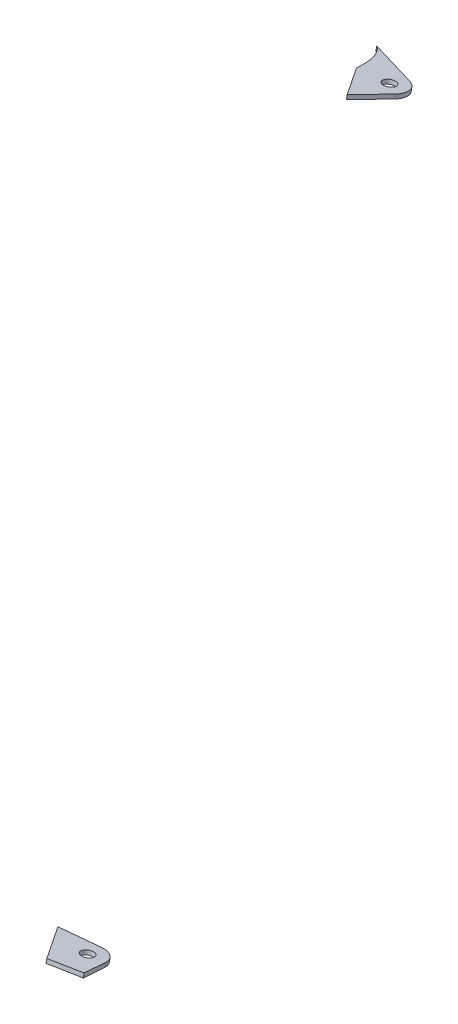
ISO-10303-21;
HEADER;
FILE_DESCRIPTION(('STEP AP214'),'2;1');
FILE_NAME('part.step','',(''),(''),'','','');
FILE_SCHEMA(('AUTOMOTIVE_DESIGN { 1 0 10303 214 1 1 1 1 }'));
ENDSEC;
DATA;
#1=APPLICATION_CONTEXT('core data for automotive mechanical design processes');
#2=APPLICATION_PROTOCOL_DEFINITION('international standard','automotive_design',2000,#1);
#3=PRODUCT_CONTEXT('',#1,'mechanical');
#4=PRODUCT('Part','Part','',(#3));
#5=PRODUCT_RELATED_PRODUCT_CATEGORY('part','',(#4));
#6=PRODUCT_DEFINITION_FORMATION('','',#4);
#7=PRODUCT_DEFINITION_CONTEXT('part definition',#1,'design');
#8=PRODUCT_DEFINITION('design','',#6,#7);
#9=PRODUCT_DEFINITION_SHAPE('','',#8);
#10=(LENGTH_UNIT() NAMED_UNIT(*) SI_UNIT(.MILLI.,.METRE.));
#11=(NAMED_UNIT(*) PLANE_ANGLE_UNIT() SI_UNIT($,.RADIAN.));
#12=(NAMED_UNIT(*) SI_UNIT($,.STERADIAN.) SOLID_ANGLE_UNIT());
#13=UNCERTAINTY_MEASURE_WITH_UNIT(LENGTH_MEASURE(1.E-05),#10,'distance_accuracy_value','');
#14=(GEOMETRIC_REPRESENTATION_CONTEXT(3) GLOBAL_UNCERTAINTY_ASSIGNED_CONTEXT((#13)) GLOBAL_UNIT_ASSIGNED_CONTEXT((#10,
#11,#12)) REPRESENTATION_CONTEXT('',''));
#15=CARTESIAN_POINT('',(0.,0.,0.));
#16=DIRECTION('',(0.,0.,1.));
#17=DIRECTION('',(1.,0.,0.));
#18=AXIS2_PLACEMENT_3D('',#15,#16,#17);
#19=CARTESIAN_POINT('',(923.569906868332,176.143738161114,-1058.06071166388));
#20=CARTESIAN_POINT('',(923.978106770845,176.194725851389,-1057.79840273711));
#21=CARTESIAN_POINT('',(924.361430621937,176.252376353669,-1057.50181661408));
#22=CARTESIAN_POINT('',(924.933250586607,176.351512786668,-1056.99180387957));
#23=CARTESIAN_POINT('',(925.135186128114,176.389480944465,-1056.79647464089));
#24=CARTESIAN_POINT('',(925.521222500008,176.467380182453,-1056.39571780326));
#25=CARTESIAN_POINT('',(925.706214443309,176.507458436446,-1056.18953306073));
#26=CARTESIAN_POINT('',(926.596451968125,176.712732275059,-1055.13349070992));
#27=CARTESIAN_POINT('',(927.201304914618,176.892533494041,-1054.20849362673));
#28=CARTESIAN_POINT('',(928.265984348611,177.270510413532,-1052.26397094762));
#29=CARTESIAN_POINT('',(928.714956528832,177.465090877903,-1051.2629412382));
#30=CARTESIAN_POINT('',(929.501728033637,177.861708895426,-1049.22251842335));
#31=CARTESIAN_POINT('',(929.83867607656,178.063803549593,-1048.18283155865));
#32=CARTESIAN_POINT('',(930.429066466174,178.473594129808,-1046.0746417835));
#33=CARTESIAN_POINT('',(930.682852112076,178.681957629434,-1045.00270450472));
#34=CARTESIAN_POINT('',(931.173926629931,179.149466366922,-1042.59758055177));
#35=CARTESIAN_POINT('',(931.393872962749,179.408729419646,-1041.26378777269));
#36=CARTESIAN_POINT('',(931.575131617797,179.668330600665,-1039.92825547433));
#37=B_SPLINE_CURVE_WITH_KNOTS('',3,(#19,#20,#21,#22,#23,#24,#25,#26,#27,#28,#29,#30,#31,#32,#33,
#34,#35,#36),.UNSPECIFIED.,.F.,.F.,(4,2,2,2,2,2,2,2,4),(0.533256834167614,0.546875000000102,
0.554687500000106,0.562500000000109,0.593750000000104,0.625000000000098,0.656250000000093,
0.687500000000087,0.726253317925459),.UNSPECIFIED.);
#38=DIRECTION('',(0.,-0.981627183447661,0.190808995376562));
#39=VECTOR('',#38,1.);
#40=SURFACE_OF_LINEAR_EXTRUSION('',#37,#39);
#41=CARTESIAN_POINT('',(923.569906868332,174.180483794219,-1057.67909367312));
#42=CARTESIAN_POINT('',(923.978106770845,174.231471484493,-1057.41678474636));
#43=CARTESIAN_POINT('',(924.361430621937,174.289121986774,-1057.12019862333));
#44=CARTESIAN_POINT('',(924.933250586607,174.388258419773,-1056.61018588881));
#45=CARTESIAN_POINT('',(925.135186128113,174.42622657757,-1056.41485665014));
#46=CARTESIAN_POINT('',(925.521222500008,174.504125815558,-1056.01409981251));
#47=CARTESIAN_POINT('',(925.706214443309,174.54420406955,-1055.80791506998));
#48=CARTESIAN_POINT('',(926.596451968125,174.749477908164,-1054.75187271916));
#49=CARTESIAN_POINT('',(927.201304914618,174.929279127146,-1053.82687563597));
#50=CARTESIAN_POINT('',(928.265984348611,175.307256046636,-1051.88235295686));
#51=CARTESIAN_POINT('',(928.714956528832,175.501836511008,-1050.88132324745));
#52=CARTESIAN_POINT('',(929.501728033637,175.898454528531,-1048.8409004326));
#53=CARTESIAN_POINT('',(929.838676076559,176.100549182698,-1047.8012135679));
#54=CARTESIAN_POINT('',(930.429066466174,176.510339762913,-1045.69302379275));
#55=CARTESIAN_POINT('',(930.682852112076,176.718703262539,-1044.62108651396));
#56=CARTESIAN_POINT('',(931.173926629931,177.186212000026,-1042.21596256102));
#57=CARTESIAN_POINT('',(931.393872962749,177.445475052751,-1040.88216978193));
#58=CARTESIAN_POINT('',(931.575131617797,177.705076233769,-1039.54663748358));
#59=B_SPLINE_CURVE_WITH_KNOTS('',3,(#41,#42,#43,#44,#45,#46,#47,#48,#49,#50,#51,#52,#53,#54,#55,
#56,#57,#58),.UNSPECIFIED.,.F.,.F.,(4,2,2,2,2,2,2,2,4),(0.533256834167614,0.546875000000102,
0.554687500000106,0.562500000000109,0.593750000000104,0.625000000000098,0.656250000000093,
0.687500000000087,0.726253317925459),.UNSPECIFIED.);
#60=CARTESIAN_POINT('',(923.569906868331,174.180483794219,-1057.67909367312));
#61=VERTEX_POINT('',#60);
#62=CARTESIAN_POINT('',(931.575131617797,177.705076233769,-1039.54663748358));
#63=VERTEX_POINT('',#62);
#64=EDGE_CURVE('E183',#61,#63,#59,.T.);
#65=ORIENTED_EDGE('',*,*,#64,.T.);
#66=DIRECTION('',(0.,-0.981627183447661,0.190808995376562));
#67=VECTOR('',#66,1.);
#68=CARTESIAN_POINT('',(931.575131617797,179.668330600665,-1039.92825547433));
#69=LINE('',#68,#67);
#70=CARTESIAN_POINT('',(931.575131617797,179.668330600665,-1039.92825547433));
#71=VERTEX_POINT('',#70);
#72=EDGE_CURVE('E123',#71,#63,#69,.T.);
#73=ORIENTED_EDGE('',*,*,#72,.F.);
#74=CARTESIAN_POINT('',(931.575131617797,179.668330600665,-1039.92825547433));
#75=CARTESIAN_POINT('',(931.393872962749,179.408729419646,-1041.26378777269));
#76=CARTESIAN_POINT('',(931.173926629931,179.149466366922,-1042.59758055177));
#77=CARTESIAN_POINT('',(930.682852112076,178.681957629434,-1045.00270450472));
#78=CARTESIAN_POINT('',(930.429066466174,178.473594129808,-1046.0746417835));
#79=CARTESIAN_POINT('',(929.83867607656,178.063803549593,-1048.18283155865));
#80=CARTESIAN_POINT('',(929.501728033637,177.861708895426,-1049.22251842335));
#81=CARTESIAN_POINT('',(928.714956528832,177.465090877903,-1051.2629412382));
#82=CARTESIAN_POINT('',(928.265984348611,177.270510413532,-1052.26397094762));
#83=CARTESIAN_POINT('',(927.201304914618,176.892533494041,-1054.20849362673));
#84=CARTESIAN_POINT('',(926.596451968125,176.712732275059,-1055.13349070992));
#85=CARTESIAN_POINT('',(925.706214443309,176.507458436446,-1056.18953306073));
#86=CARTESIAN_POINT('',(925.521222500008,176.467380182453,-1056.39571780326));
#87=CARTESIAN_POINT('',(925.135186128114,176.389480944465,-1056.79647464089));
#88=CARTESIAN_POINT('',(924.933250586607,176.351512786668,-1056.99180387957));
#89=CARTESIAN_POINT('',(924.361430621937,176.252376353669,-1057.50181661408));
#90=CARTESIAN_POINT('',(923.978106770845,176.194725851389,-1057.79840273711));
#91=CARTESIAN_POINT('',(923.569906868332,176.143738161114,-1058.06071166388));
#92=B_SPLINE_CURVE_WITH_KNOTS('',3,(#74,#75,#76,#77,#78,#79,#80,#81,#82,#83,#84,#85,#86,#87,#88,
#89,#90,#91),.UNSPECIFIED.,.F.,.F.,(4,2,2,2,2,2,2,2,4),(0.533256834167614,0.572010152092986,
0.60326015209298,0.634510152092975,0.665760152092969,0.697010152092964,0.704822652092967,
0.712635152092971,0.726253317925459),.UNSPECIFIED.);
#93=CARTESIAN_POINT('',(923.569906868332,176.143738161114,-1058.06071166388));
#94=VERTEX_POINT('',#93);
#95=EDGE_CURVE('E136',#94,#71,#92,.F.);
#96=ORIENTED_EDGE('',*,*,#95,.F.);
#97=DIRECTION('',(0.,-0.981627183447661,0.190808995376562));
#98=VECTOR('',#97,1.);
#99=CARTESIAN_POINT('',(923.569906868332,176.143738161114,-1058.06071166388));
#100=LINE('',#99,#98);
#101=EDGE_CURVE('E12',#94,#61,#100,.T.);
#102=ORIENTED_EDGE('',*,*,#101,.T.);
#103=EDGE_LOOP('',(#65,#73,#96,#102));
#104=FACE_BOUND('',#103,.T.);
#105=ADVANCED_FACE('F47',(#104),#40,.F.);
#106=CARTESIAN_POINT('',(948.510924792447,177.8079708982,-1049.49897645279));
#107=DIRECTION('',(0.330101796520686,-0.180113261917371,-0.926602404926352));
#108=DIRECTION('',(0.942008120863403,0.,0.335590077665297));
#109=AXIS2_PLACEMENT_3D('',#106,#107,#108);
#110=PLANE('',#109);
#111=DIRECTION('',(-0.943945339484133,-0.0629863921660654,-0.324036896769623));
#112=VECTOR('',#111,1.);
#113=CARTESIAN_POINT('',(948.510924792447,175.844716531305,-1049.11735846203));
#114=LINE('',#113,#112);
#115=CARTESIAN_POINT('',(948.510924792447,175.844716531305,-1049.11735846203));
#116=VERTEX_POINT('',#115);
#117=EDGE_CURVE('E95',#116,#61,#114,.T.);
#118=ORIENTED_EDGE('',*,*,#117,.T.);
#119=ORIENTED_EDGE('',*,*,#101,.F.);
#120=DIRECTION('',(-0.943945339484133,-0.0629863921660654,-0.324036896769623));
#121=VECTOR('',#120,1.);
#122=CARTESIAN_POINT('',(948.510924792447,177.8079708982,-1049.49897645279));
#123=LINE('',#122,#121);
#124=CARTESIAN_POINT('',(948.510924792447,177.8079708982,-1049.49897645279));
#125=VERTEX_POINT('',#124);
#126=EDGE_CURVE('E69',#125,#94,#123,.T.);
#127=ORIENTED_EDGE('',*,*,#126,.F.);
#128=DIRECTION('',(0.,-0.981627183447661,0.190808995376562));
#129=VECTOR('',#128,1.);
#130=CARTESIAN_POINT('',(948.510924792447,177.8079708982,-1049.49897645279));
#131=LINE('',#130,#129);
#132=EDGE_CURVE('E60',#125,#116,#131,.T.);
#133=ORIENTED_EDGE('',*,*,#132,.T.);
#134=EDGE_LOOP('',(#118,#119,#127,#133));
#135=FACE_BOUND('',#134,.T.);
#136=ADVANCED_FACE('F167',(#135),#110,.T.);
#137=CARTESIAN_POINT('',(945.870110420281,179.248876993539,-1042.08615721338));
#138=DIRECTION('',(0.,-0.981627183447661,0.190808995376562));
#139=DIRECTION('',(0.,0.190808995376562,0.981627183447661));
#140=AXIS2_PLACEMENT_3D('',#137,#138,#139);
#141=CYLINDRICAL_SURFACE('',#140,7.9999999999999);
#142=CARTESIAN_POINT('',(945.870110420281,177.285622626644,-1041.70453922262));
#143=DIRECTION('',(0.,0.981627183447661,-0.190808995376562));
#144=DIRECTION('',(0.,0.190808995376562,0.981627183447661));
#145=AXIS2_PLACEMENT_3D('',#142,#143,#144);
#146=CIRCLE('',#145,7.9999999999999);
#147=CARTESIAN_POINT('',(952.848375326948,178.032069243004,-1037.86440428472));
#148=VERTEX_POINT('',#147);
#149=EDGE_CURVE('E89',#148,#116,#146,.T.);
#150=ORIENTED_EDGE('',*,*,#149,.T.);
#151=ORIENTED_EDGE('',*,*,#132,.F.);
#152=CARTESIAN_POINT('',(945.870110420281,179.248876993539,-1042.08615721338));
#153=DIRECTION('',(0.,0.981627183447661,-0.190808995376562));
#154=DIRECTION('',(0.,0.190808995376562,0.981627183447661));
#155=AXIS2_PLACEMENT_3D('',#152,#153,#154);
#156=CIRCLE('',#155,7.9999999999999);
#157=CARTESIAN_POINT('',(952.848375326948,179.995323609899,-1038.24602227547));
#158=VERTEX_POINT('',#157);
#159=EDGE_CURVE('E111',#158,#125,#156,.T.);
#160=ORIENTED_EDGE('',*,*,#159,.F.);
#161=DIRECTION('',(0.,-0.981627183447661,0.190808995376562));
#162=VECTOR('',#161,1.);
#163=CARTESIAN_POINT('',(952.848375326948,179.995323609899,-1038.24602227547));
#164=LINE('',#163,#162);
#165=EDGE_CURVE('E115',#158,#148,#164,.T.);
#166=ORIENTED_EDGE('',*,*,#165,.T.);
#167=EDGE_LOOP('',(#150,#151,#160,#166));
#168=FACE_BOUND('',#167,.T.);
#169=ADVANCED_FACE('F121',(#168),#141,.T.);
#170=CARTESIAN_POINT('',(952.848375326948,179.995323609899,-1038.24602227547));
#171=DIRECTION('',(0.872283113333319,0.0933058270450055,0.480016867237997));
#172=DIRECTION('',(-0.482120118377002,0.,0.876105125801776));
#173=AXIS2_PLACEMENT_3D('',#170,#171,#172);
#174=PLANE('',#173);
#175=DIRECTION('',(0.489001196515441,-0.166439464539093,-0.856256815710338));
#176=VECTOR('',#175,1.);
#177=CARTESIAN_POINT('',(952.848375326948,178.032069243004,-1037.86440428472));
#178=LINE('',#177,#176);
#179=CARTESIAN_POINT('',(944.055127391948,181.0249933673,-1022.46714446158));
#180=VERTEX_POINT('',#179);
#181=EDGE_CURVE('E118',#180,#148,#178,.T.);
#182=ORIENTED_EDGE('',*,*,#181,.T.);
#183=ORIENTED_EDGE('',*,*,#165,.F.);
#184=DIRECTION('',(0.489001196515441,-0.166439464539093,-0.856256815710338));
#185=VECTOR('',#184,1.);
#186=CARTESIAN_POINT('',(952.848375326948,179.995323609899,-1038.24602227547));
#187=LINE('',#186,#185);
#188=CARTESIAN_POINT('',(944.055127391949,182.988247734195,-1022.84876245233));
#189=VERTEX_POINT('',#188);
#190=EDGE_CURVE('E107',#189,#158,#187,.T.);
#191=ORIENTED_EDGE('',*,*,#190,.F.);
#192=DIRECTION('',(0.,-0.981627183447661,0.190808995376562));
#193=VECTOR('',#192,1.);
#194=CARTESIAN_POINT('',(944.055127391949,182.988247734195,-1022.84876245233));
#195=LINE('',#194,#193);
#196=EDGE_CURVE('E119',#189,#180,#195,.T.);
#197=ORIENTED_EDGE('',*,*,#196,.T.);
#198=EDGE_LOOP('',(#182,#183,#191,#197));
#199=FACE_BOUND('',#198,.T.);
#200=ADVANCED_FACE('F116',(#199),#174,.T.);
#201=CARTESIAN_POINT('',(931.575131617797,179.668330600665,-1039.92825547433));
#202=CARTESIAN_POINT('',(935.736568160242,180.775348076132,-1034.23314427516));
#203=CARTESIAN_POINT('',(939.896568770962,181.881987657761,-1028.53997717126));
#204=CARTESIAN_POINT('',(944.055127391949,182.988247734195,-1022.84876245233));
#205=(BOUNDED_CURVE() B_SPLINE_CURVE(3,(#201,#202,#203,#204),.UNSPECIFIED.,.F.,
.F.) B_SPLINE_CURVE_WITH_KNOTS((4,4),(0.,0.0294757023408717),
.UNSPECIFIED.) CURVE() GEOMETRIC_REPRESENTATION_ITEM() RATIONAL_B_SPLINE_CURVE((1.,
0.999983717419373,0.999967914779245,0.999952592079617)) REPRESENTATION_ITEM(''));
#206=DIRECTION('',(0.,-0.981627183447661,0.190808995376562));
#207=VECTOR('',#206,1.);
#208=SURFACE_OF_LINEAR_EXTRUSION('',#205,#207);
#209=CARTESIAN_POINT('',(931.575131617797,177.705076233769,-1039.54663748358));
#210=CARTESIAN_POINT('',(935.736568160242,178.812093709237,-1033.85152628441));
#211=CARTESIAN_POINT('',(939.896568770962,179.918733290866,-1028.15835918051));
#212=CARTESIAN_POINT('',(944.055127391948,181.0249933673,-1022.46714446158));
#213=(BOUNDED_CURVE() B_SPLINE_CURVE(3,(#209,#210,#211,#212),.UNSPECIFIED.,.F.,
.F.) B_SPLINE_CURVE_WITH_KNOTS((4,4),(0.,0.0294757023408717),
.UNSPECIFIED.) CURVE() GEOMETRIC_REPRESENTATION_ITEM() RATIONAL_B_SPLINE_CURVE((1.,
0.999983717419373,0.999967914779245,0.999952592079617)) REPRESENTATION_ITEM(''));
#214=EDGE_CURVE('E128',#63,#180,#213,.T.);
#215=ORIENTED_EDGE('',*,*,#214,.T.);
#216=ORIENTED_EDGE('',*,*,#196,.F.);
#217=EDGE_CURVE('E103',#71,#189,#205,.T.);
#218=ORIENTED_EDGE('',*,*,#217,.F.);
#219=ORIENTED_EDGE('',*,*,#72,.T.);
#220=EDGE_LOOP('',(#215,#216,#218,#219));
#221=FACE_BOUND('',#220,.T.);
#222=ADVANCED_FACE('F160',(#221),#208,.F.);
#223=CARTESIAN_POINT('',(929.284049441677,177.754184912222,-1049.77568136296));
#224=DIRECTION('',(1.78421516544111E-13,-0.981627183447715,0.190808995376283));
#225=DIRECTION('',(0.,0.190808995376283,0.981627183447715));
#226=AXIS2_PLACEMENT_3D('',#223,#224,#225);
#227=PLANE('',#226);
#228=CARTESIAN_POINT('',(945.870110420281,179.248876993539,-1042.08615721338));
#229=DIRECTION('',(0.,0.981627183447661,-0.190808995376562));
#230=DIRECTION('',(0.,0.190808995376562,0.981627183447661));
#231=AXIS2_PLACEMENT_3D('',#228,#229,#230);
#232=CIRCLE('',#231,2.99999999999994);
#233=CARTESIAN_POINT('',(945.870110420281,179.821303979669,-1039.14127566303));
#234=VERTEX_POINT('',#233);
#235=EDGE_CURVE('E194',#234,#234,#232,.T.);
#236=ORIENTED_EDGE('',*,*,#235,.F.);
#237=EDGE_LOOP('',(#236));
#238=FACE_BOUND('',#237,.T.);
#239=ORIENTED_EDGE('',*,*,#95,.T.);
#240=ORIENTED_EDGE('',*,*,#217,.T.);
#241=ORIENTED_EDGE('',*,*,#190,.T.);
#242=ORIENTED_EDGE('',*,*,#159,.T.);
#243=ORIENTED_EDGE('',*,*,#126,.T.);
#244=EDGE_LOOP('',(#239,#240,#241,#242,#243));
#245=FACE_BOUND('',#244,.T.);
#246=ADVANCED_FACE('F109',(#238,#245),#227,.F.);
#247=CARTESIAN_POINT('',(929.284049441677,175.790930545327,-1049.3940633722));
#248=DIRECTION('',(1.78421516544111E-13,-0.981627183447715,0.190808995376283));
#249=DIRECTION('',(0.,0.190808995376283,0.981627183447715));
#250=AXIS2_PLACEMENT_3D('',#247,#248,#249);
#251=PLANE('',#250);
#252=CARTESIAN_POINT('',(945.870110420281,177.285622626644,-1041.70453922262));
#253=DIRECTION('',(0.,0.981627183447661,-0.190808995376562));
#254=DIRECTION('',(0.,0.190808995376562,0.981627183447661));
#255=AXIS2_PLACEMENT_3D('',#252,#253,#254);
#256=CIRCLE('',#255,2.99999999999994);
#257=CARTESIAN_POINT('',(945.870110420281,177.858049612773,-1038.75965767228));
#258=VERTEX_POINT('',#257);
#259=EDGE_CURVE('E196',#258,#258,#256,.T.);
#260=ORIENTED_EDGE('',*,*,#259,.T.);
#261=EDGE_LOOP('',(#260));
#262=FACE_BOUND('',#261,.T.);
#263=ORIENTED_EDGE('',*,*,#64,.F.);
#264=ORIENTED_EDGE('',*,*,#117,.F.);
#265=ORIENTED_EDGE('',*,*,#149,.F.);
#266=ORIENTED_EDGE('',*,*,#181,.F.);
#267=ORIENTED_EDGE('',*,*,#214,.F.);
#268=EDGE_LOOP('',(#263,#264,#265,#266,#267));
#269=FACE_BOUND('',#268,.T.);
#270=ADVANCED_FACE('F159',(#262,#269),#251,.T.);
#271=CARTESIAN_POINT('',(945.870110420281,179.248876993539,-1042.08615721338));
#272=DIRECTION('',(0.,-0.981627183447661,0.190808995376562));
#273=DIRECTION('',(0.,0.190808995376562,0.981627183447661));
#274=AXIS2_PLACEMENT_3D('',#271,#272,#273);
#275=CYLINDRICAL_SURFACE('',#274,2.99999999999994);
#276=ORIENTED_EDGE('',*,*,#235,.T.);
#277=EDGE_LOOP('',(#276));
#278=FACE_BOUND('',#277,.T.);
#279=ORIENTED_EDGE('',*,*,#259,.F.);
#280=EDGE_LOOP('',(#279));
#281=FACE_BOUND('',#280,.T.);
#282=ADVANCED_FACE('F162',(#278,#281),#275,.F.);
#283=CLOSED_SHELL('',(#105,#136,#169,#200,#222,#246,#270,#282));
#284=MANIFOLD_SOLID_BREP('B2',#283);
#285=CARTESIAN_POINT('',(1334.80841022403,286.948805486564,-488.018057564818));
#286=CARTESIAN_POINT('',(1339.77571566488,288.27052628098,-481.218393543913));
#287=CARTESIAN_POINT('',(1344.74018481782,289.591498692982,-474.422579616761));
#288=CARTESIAN_POINT('',(1349.70180710941,290.911719908774,-467.63063025909));
#289=(BOUNDED_CURVE() B_SPLINE_CURVE(3,(#285,#286,#287,#288),.UNSPECIFIED.,.F.,
.F.) B_SPLINE_CURVE_WITH_KNOTS((4,4),(0.963874291107527,1.),
.UNSPECIFIED.) CURVE() GEOMETRIC_REPRESENTATION_ITEM() RATIONAL_B_SPLINE_CURVE((0.999942294513788,
0.999960808747962,0.999980043910033,1.)) REPRESENTATION_ITEM(''));
#290=DIRECTION('',(0.,-0.981627183447661,0.190808995376562));
#291=VECTOR('',#290,1.);
#292=SURFACE_OF_LINEAR_EXTRUSION('',#289,#291);
#293=CARTESIAN_POINT('',(1334.80841022403,284.985551119669,-487.636439574065));
#294=CARTESIAN_POINT('',(1339.77571566488,286.307271914085,-480.83677555316));
#295=CARTESIAN_POINT('',(1344.74018481782,287.628244326087,-474.040961626008));
#296=CARTESIAN_POINT('',(1349.70180710941,288.948465541879,-467.249012268337));
#297=(BOUNDED_CURVE() B_SPLINE_CURVE(3,(#293,#294,#295,#296),.UNSPECIFIED.,.F.,
.F.) B_SPLINE_CURVE_WITH_KNOTS((4,4),(0.963874291107527,1.),
.UNSPECIFIED.) CURVE() GEOMETRIC_REPRESENTATION_ITEM() RATIONAL_B_SPLINE_CURVE((0.999942294513788,
0.999960808747962,0.999980043910033,1.)) REPRESENTATION_ITEM(''));
#298=CARTESIAN_POINT('',(1334.80841022403,284.985551119669,-487.636439574065));
#299=VERTEX_POINT('',#298);
#300=CARTESIAN_POINT('',(1349.70180710889,288.948465541898,-467.249012268237));
#301=VERTEX_POINT('',#300);
#302=EDGE_CURVE('E362',#299,#301,#297,.T.);
#303=ORIENTED_EDGE('',*,*,#302,.T.);
#304=DIRECTION('',(0.,-0.981627183447661,0.190808995376562));
#305=VECTOR('',#304,1.);
#306=CARTESIAN_POINT('',(1349.70180710889,290.911719908793,-467.63063025899));
#307=LINE('',#306,#305);
#308=CARTESIAN_POINT('',(1349.70180710889,290.911719908793,-467.63063025899));
#309=VERTEX_POINT('',#308);
#310=EDGE_CURVE('E290',#309,#301,#307,.T.);
#311=ORIENTED_EDGE('',*,*,#310,.F.);
#312=CARTESIAN_POINT('',(1334.80841022403,286.948805486564,-488.018057564818));
#313=VERTEX_POINT('',#312);
#314=EDGE_CURVE('E380',#313,#309,#289,.T.);
#315=ORIENTED_EDGE('',*,*,#314,.F.);
#316=DIRECTION('',(0.,-0.981627183447661,0.190808995376562));
#317=VECTOR('',#316,1.);
#318=CARTESIAN_POINT('',(1334.80841022403,286.948805486564,-488.018057564818));
#319=LINE('',#318,#317);
#320=EDGE_CURVE('E45',#313,#299,#319,.T.);
#321=ORIENTED_EDGE('',*,*,#320,.T.);
#322=EDGE_LOOP('',(#303,#311,#315,#321));
#323=FACE_BOUND('',#322,.T.);
#324=ADVANCED_FACE('F286',(#323),#292,.F.);
#325=CARTESIAN_POINT('',(1353.96749539418,286.478008377176,-490.440098724625));
#326=DIRECTION('',(-0.127728639493142,-0.189246107962099,-0.97358682472311));
#327=DIRECTION('',(0.,-0.981627183447662,0.190808995376555));
#328=AXIS2_PLACEMENT_3D('',#325,#326,#327);
#329=PLANE('',#328);
#330=DIRECTION('',(-0.991809152333871,0.0243717733825484,0.125381904631246));
#331=VECTOR('',#330,1.);
#332=CARTESIAN_POINT('',(1353.96749539418,284.51475401028,-490.058480733872));
#333=LINE('',#332,#331);
#334=CARTESIAN_POINT('',(1353.96749539418,284.51475401028,-490.058480733872));
#335=VERTEX_POINT('',#334);
#336=EDGE_CURVE('E331',#335,#299,#333,.T.);
#337=ORIENTED_EDGE('',*,*,#336,.T.);
#338=ORIENTED_EDGE('',*,*,#320,.F.);
#339=DIRECTION('',(-0.991809152333871,0.0243717733825484,0.125381904631246));
#340=VECTOR('',#339,1.);
#341=CARTESIAN_POINT('',(1353.96749539418,286.478008377176,-490.440098724625));
#342=LINE('',#341,#340);
#343=CARTESIAN_POINT('',(1353.96749539418,286.478008377176,-490.440098724625));
#344=VERTEX_POINT('',#343);
#345=EDGE_CURVE('E305',#344,#313,#342,.T.);
#346=ORIENTED_EDGE('',*,*,#345,.F.);
#347=DIRECTION('',(0.,-0.981627183447661,0.190808995376562));
#348=VECTOR('',#347,1.);
#349=CARTESIAN_POINT('',(1353.96749539418,286.478008377176,-490.440098724625));
#350=LINE('',#349,#348);
#351=EDGE_CURVE('E296',#344,#335,#350,.T.);
#352=ORIENTED_EDGE('',*,*,#351,.T.);
#353=EDGE_LOOP('',(#337,#338,#346,#352));
#354=FACE_BOUND('',#353,.T.);
#355=ADVANCED_FACE('F404',(#354),#329,.T.);
#356=CARTESIAN_POINT('',(1354.98932451013,287.991977240872,-482.651404126841));
#357=DIRECTION('',(0.,-0.981627183447661,0.190808995376562));
#358=DIRECTION('',(0.,0.190808995376562,0.981627183447661));
#359=AXIS2_PLACEMENT_3D('',#356,#357,#358);
#360=CYLINDRICAL_SURFACE('',#359,7.99999999999984);
#361=CARTESIAN_POINT('',(1354.98932451013,286.028722873977,-482.269786136087));
#362=DIRECTION('',(0.,0.981627183447661,-0.190808995376562));
#363=DIRECTION('',(0.,0.190808995376562,0.981627183447661));
#364=AXIS2_PLACEMENT_3D('',#361,#362,#363);
#365=CIRCLE('',#364,7.99999999999984);
#366=CARTESIAN_POINT('',(1362.9237977288,285.833748686917,-483.272841373136));
#367=VERTEX_POINT('',#366);
#368=EDGE_CURVE('E325',#367,#335,#365,.T.);
#369=ORIENTED_EDGE('',*,*,#368,.T.);
#370=ORIENTED_EDGE('',*,*,#351,.F.);
#371=CARTESIAN_POINT('',(1354.98932451013,287.991977240872,-482.651404126841));
#372=DIRECTION('',(0.,0.981627183447661,-0.190808995376562));
#373=DIRECTION('',(0.,0.190808995376562,0.981627183447661));
#374=AXIS2_PLACEMENT_3D('',#371,#372,#373);
#375=CIRCLE('',#374,7.99999999999984);
#376=CARTESIAN_POINT('',(1362.9237977288,287.797003053812,-483.654459363889));
#377=VERTEX_POINT('',#376);
#378=EDGE_CURVE('E347',#377,#344,#375,.T.);
#379=ORIENTED_EDGE('',*,*,#378,.F.);
#380=DIRECTION('',(0.,-0.981627183447661,0.190808995376562));
#381=VECTOR('',#380,1.);
#382=CARTESIAN_POINT('',(1362.9237977288,287.797003053812,-483.654459363889));
#383=LINE('',#382,#381);
#384=EDGE_CURVE('E351',#377,#367,#383,.T.);
#385=ORIENTED_EDGE('',*,*,#384,.T.);
#386=EDGE_LOOP('',(#369,#370,#379,#385));
#387=FACE_BOUND('',#386,.T.);
#388=ADVANCED_FACE('F357',(#387),#360,.T.);
#389=CARTESIAN_POINT('',(1362.9237977288,287.797003053812,-483.654459363889));
#390=DIRECTION('',(0.991809152333896,-0.0243717733825124,-0.125381904631054));
#391=DIRECTION('',(0.125419158609164,0.,0.992103842676647));
#392=AXIS2_PLACEMENT_3D('',#389,#390,#391);
#393=PLANE('',#392);
#394=DIRECTION('',(-0.127728639492947,-0.189246107962104,-0.973586824723135));
#395=VECTOR('',#394,1.);
#396=CARTESIAN_POINT('',(1362.9237977288,285.833748686917,-483.272841373136));
#397=LINE('',#396,#395);
#398=CARTESIAN_POINT('',(1364.53800027905,288.225393593619,-470.968894963586));
#399=VERTEX_POINT('',#398);
#400=EDGE_CURVE('E354',#399,#367,#397,.T.);
#401=ORIENTED_EDGE('',*,*,#400,.T.);
#402=ORIENTED_EDGE('',*,*,#384,.F.);
#403=DIRECTION('',(-0.127728639492947,-0.189246107962104,-0.973586824723135));
#404=VECTOR('',#403,1.);
#405=CARTESIAN_POINT('',(1362.9237977288,287.797003053812,-483.654459363889));
#406=LINE('',#405,#404);
#407=CARTESIAN_POINT('',(1364.53800027905,290.188647960514,-471.350512954339));
#408=VERTEX_POINT('',#407);
#409=EDGE_CURVE('E343',#408,#377,#406,.T.);
#410=ORIENTED_EDGE('',*,*,#409,.F.);
#411=DIRECTION('',(0.,-0.981627183447661,0.190808995376562));
#412=VECTOR('',#411,1.);
#413=CARTESIAN_POINT('',(1364.53800027905,290.188647960514,-471.350512954339));
#414=LINE('',#413,#412);
#415=EDGE_CURVE('E355',#408,#399,#414,.T.);
#416=ORIENTED_EDGE('',*,*,#415,.T.);
#417=EDGE_LOOP('',(#401,#402,#410,#416));
#418=FACE_BOUND('',#417,.T.);
#419=ADVANCED_FACE('F352',(#418),#393,.T.);
#420=CARTESIAN_POINT('',(1372.5869732104,293.565106203346,-453.980141141423));
#421=CARTESIAN_POINT('',(1311.291058855,299.283641775688,-424.560825997283));
#422=CARTESIAN_POINT('',(1234.05225556846,303.431820967833,-403.220294075388));
#423=CARTESIAN_POINT('',(1229.97149861866,301.224398152558,-414.576499984655));
#424=CARTESIAN_POINT('',(1225.89074166887,299.016975337283,-425.932705893922));
#425=CARTESIAN_POINT('',(1299.67549991029,293.000383512042,-456.885387530902));
#426=CARTESIAN_POINT('',(1366.2093462611,290.11522682842,-471.728231934314));
#427=(BOUNDED_CURVE() B_SPLINE_CURVE(3,(#420,#421,#422,#423,#424,#425,#426),.UNSPECIFIED.,.F.,
.F.) B_SPLINE_CURVE_WITH_KNOTS((4,3,4),(0.,0.5,1.),
.UNSPECIFIED.) CURVE() GEOMETRIC_REPRESENTATION_ITEM() RATIONAL_B_SPLINE_CURVE((1.,
0.615474211248719,0.615474211248719,1.,0.615474211248719,0.615474211248719,1.)) REPRESENTATION_ITEM(''));
#428=DIRECTION('',(0.,-0.981627183447661,0.190808995376562));
#429=VECTOR('',#428,1.);
#430=SURFACE_OF_LINEAR_EXTRUSION('',#427,#429);
#431=CARTESIAN_POINT('',(1372.5869732104,291.601851836451,-453.59852315067));
#432=CARTESIAN_POINT('',(1311.291058855,297.320387408792,-424.179208006529));
#433=CARTESIAN_POINT('',(1234.05225556846,301.468566600938,-402.838676084635));
#434=CARTESIAN_POINT('',(1229.97149861866,299.261143785663,-414.194881993902));
#435=CARTESIAN_POINT('',(1225.89074166887,297.053720970388,-425.551087903169));
#436=CARTESIAN_POINT('',(1299.67549991029,291.037129145146,-456.503769540149));
#437=CARTESIAN_POINT('',(1366.2093462611,288.151972461524,-471.346613943561));
#438=(BOUNDED_CURVE() B_SPLINE_CURVE(3,(#431,#432,#433,#434,#435,#436,#437),.UNSPECIFIED.,.F.,
.F.) B_SPLINE_CURVE_WITH_KNOTS((4,3,4),(0.,0.5,1.),
.UNSPECIFIED.) CURVE() GEOMETRIC_REPRESENTATION_ITEM() RATIONAL_B_SPLINE_CURVE((1.,
0.615474211248719,0.615474211248719,1.,0.615474211248719,0.615474211248719,1.)) REPRESENTATION_ITEM(''));
#439=EDGE_CURVE('E367',#301,#399,#438,.T.);
#440=ORIENTED_EDGE('',*,*,#439,.T.);
#441=ORIENTED_EDGE('',*,*,#415,.F.);
#442=EDGE_CURVE('E339',#309,#408,#427,.T.);
#443=ORIENTED_EDGE('',*,*,#442,.F.);
#444=ORIENTED_EDGE('',*,*,#310,.T.);
#445=EDGE_LOOP('',(#440,#441,#443,#444));
#446=FACE_BOUND('',#445,.T.);
#447=ADVANCED_FACE('F383',(#446),#430,.F.);
#448=CARTESIAN_POINT('',(1342.25731146865,288.930844096941,-477.821352871996));
#449=DIRECTION('',(-1.35053076008723E-10,-0.981627183432281,0.190808995455682));
#450=DIRECTION('',(0.,0.190808995455682,0.981627183432281));
#451=AXIS2_PLACEMENT_3D('',#448,#449,#450);
#452=PLANE('',#451);
#453=CARTESIAN_POINT('',(1354.98932451013,287.991977240872,-482.651404126841));
#454=DIRECTION('',(0.,0.981627183447661,-0.190808995376562));
#455=DIRECTION('',(0.,0.190808995376562,0.981627183447661));
#456=AXIS2_PLACEMENT_3D('',#453,#454,#455);
#457=CIRCLE('',#456,2.99999999999994);
#458=CARTESIAN_POINT('',(1354.98932451013,288.564404227002,-479.706522576498));
#459=VERTEX_POINT('',#458);
#460=EDGE_CURVE('E368',#459,#459,#457,.T.);
#461=ORIENTED_EDGE('',*,*,#460,.F.);
#462=EDGE_LOOP('',(#461));
#463=FACE_BOUND('',#462,.T.);
#464=ORIENTED_EDGE('',*,*,#314,.T.);
#465=ORIENTED_EDGE('',*,*,#442,.T.);
#466=ORIENTED_EDGE('',*,*,#409,.T.);
#467=ORIENTED_EDGE('',*,*,#378,.T.);
#468=ORIENTED_EDGE('',*,*,#345,.T.);
#469=EDGE_LOOP('',(#464,#465,#466,#467,#468));
#470=FACE_BOUND('',#469,.T.);
#471=ADVANCED_FACE('F345',(#463,#470),#452,.F.);
#472=CARTESIAN_POINT('',(1342.25731146865,286.967589730045,-477.439734881243));
#473=DIRECTION('',(-1.35053076008723E-10,-0.981627183432281,0.190808995455682));
#474=DIRECTION('',(0.,0.190808995455682,0.981627183432281));
#475=AXIS2_PLACEMENT_3D('',#472,#473,#474);
#476=PLANE('',#475);
#477=CARTESIAN_POINT('',(1354.98932451013,286.028722873977,-482.269786136087));
#478=DIRECTION('',(0.,0.981627183447661,-0.190808995376562));
#479=DIRECTION('',(0.,0.190808995376562,0.981627183447661));
#480=AXIS2_PLACEMENT_3D('',#477,#478,#479);
#481=CIRCLE('',#480,2.99999999999994);
#482=CARTESIAN_POINT('',(1354.98932451013,286.601149860107,-479.324904585744));
#483=VERTEX_POINT('',#482);
#484=EDGE_CURVE('E425',#483,#483,#481,.T.);
#485=ORIENTED_EDGE('',*,*,#484,.T.);
#486=EDGE_LOOP('',(#485));
#487=FACE_BOUND('',#486,.T.);
#488=ORIENTED_EDGE('',*,*,#302,.F.);
#489=ORIENTED_EDGE('',*,*,#336,.F.);
#490=ORIENTED_EDGE('',*,*,#368,.F.);
#491=ORIENTED_EDGE('',*,*,#400,.F.);
#492=ORIENTED_EDGE('',*,*,#439,.F.);
#493=EDGE_LOOP('',(#488,#489,#490,#491,#492));
#494=FACE_BOUND('',#493,.T.);
#495=ADVANCED_FACE('F388',(#487,#494),#476,.T.);
#496=CARTESIAN_POINT('',(1354.98932451013,287.991977240872,-482.651404126841));
#497=DIRECTION('',(0.,-0.981627183447661,0.190808995376562));
#498=DIRECTION('',(0.,0.190808995376562,0.981627183447661));
#499=AXIS2_PLACEMENT_3D('',#496,#497,#498);
#500=CYLINDRICAL_SURFACE('',#499,2.99999999999994);
#501=ORIENTED_EDGE('',*,*,#460,.T.);
#502=EDGE_LOOP('',(#501));
#503=FACE_BOUND('',#502,.T.);
#504=ORIENTED_EDGE('',*,*,#484,.F.);
#505=EDGE_LOOP('',(#504));
#506=FACE_BOUND('',#505,.T.);
#507=ADVANCED_FACE('F390',(#503,#506),#500,.F.);
#508=CLOSED_SHELL('',(#324,#355,#388,#419,#447,#471,#495,#507));
#509=MANIFOLD_SOLID_BREP('B6',#508);
#510=ADVANCED_BREP_SHAPE_REPRESENTATION('',(#18,#284,#509),#14);
#511=SHAPE_DEFINITION_REPRESENTATION(#9,#510);
ENDSEC;
END-ISO-10303-21;
